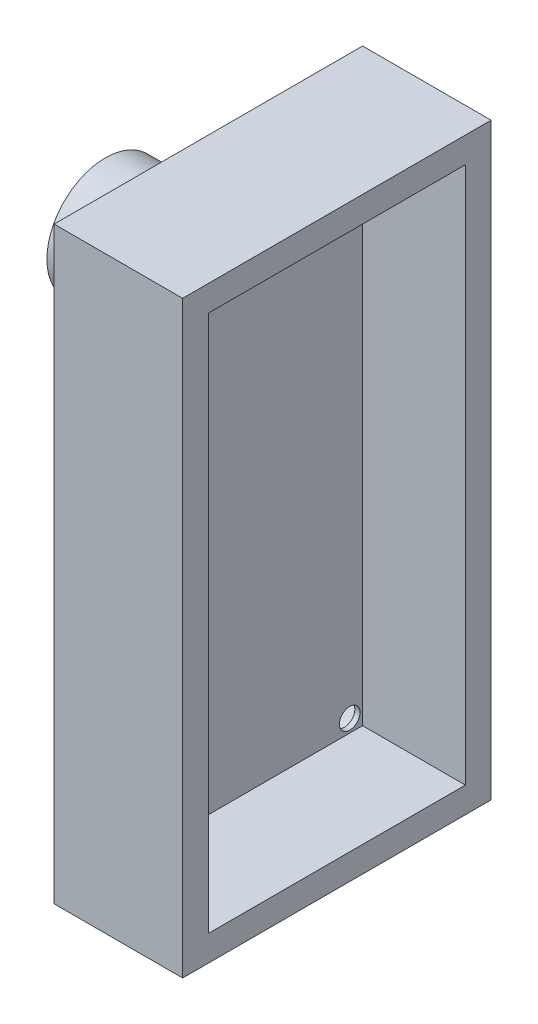
ISO-10303-21;
HEADER;
FILE_DESCRIPTION(('STEP AP214'),'2;1');
FILE_NAME('part.step','',(''),(''),'','','');
FILE_SCHEMA(('AUTOMOTIVE_DESIGN { 1 0 10303 214 1 1 1 1 }'));
ENDSEC;
DATA;
#1=APPLICATION_CONTEXT('core data for automotive mechanical design processes');
#2=APPLICATION_PROTOCOL_DEFINITION('international standard','automotive_design',2000,#1);
#3=PRODUCT_CONTEXT('',#1,'mechanical');
#4=PRODUCT('Part','Part','',(#3));
#5=PRODUCT_RELATED_PRODUCT_CATEGORY('part','',(#4));
#6=PRODUCT_DEFINITION_FORMATION('','',#4);
#7=PRODUCT_DEFINITION_CONTEXT('part definition',#1,'design');
#8=PRODUCT_DEFINITION('design','',#6,#7);
#9=PRODUCT_DEFINITION_SHAPE('','',#8);
#10=(LENGTH_UNIT() NAMED_UNIT(*) SI_UNIT(.MILLI.,.METRE.));
#11=(NAMED_UNIT(*) PLANE_ANGLE_UNIT() SI_UNIT($,.RADIAN.));
#12=(NAMED_UNIT(*) SI_UNIT($,.STERADIAN.) SOLID_ANGLE_UNIT());
#13=UNCERTAINTY_MEASURE_WITH_UNIT(LENGTH_MEASURE(1.E-05),#10,'distance_accuracy_value','');
#14=(GEOMETRIC_REPRESENTATION_CONTEXT(3) GLOBAL_UNCERTAINTY_ASSIGNED_CONTEXT((#13)) GLOBAL_UNIT_ASSIGNED_CONTEXT((#10,
#11,#12)) REPRESENTATION_CONTEXT('',''));
#15=CARTESIAN_POINT('',(0.,0.,0.));
#16=DIRECTION('',(0.,0.,1.));
#17=DIRECTION('',(1.,0.,0.));
#18=AXIS2_PLACEMENT_3D('',#15,#16,#17);
#19=CARTESIAN_POINT('',(5.,0.,0.));
#20=DIRECTION('',(-1.,0.,0.));
#21=DIRECTION('',(0.,0.,1.));
#22=AXIS2_PLACEMENT_3D('',#19,#20,#21);
#23=PLANE('',#22);
#24=DIRECTION('',(0.,1.,0.));
#25=VECTOR('',#24,1.);
#26=CARTESIAN_POINT('',(5.,-12.709853200062,11.9875854542043));
#27=LINE('',#26,#25);
#28=CARTESIAN_POINT('',(5.,-35.609853200062,11.9875854542043));
#29=VERTEX_POINT('',#28);
#30=CARTESIAN_POINT('',(5.,-12.709853200062,11.9875854542043));
#31=VERTEX_POINT('',#30);
#32=EDGE_CURVE('E145',#29,#31,#27,.T.);
#33=ORIENTED_EDGE('',*,*,#32,.T.);
#34=DIRECTION('',(0.,0.,1.));
#35=VECTOR('',#34,1.);
#36=CARTESIAN_POINT('',(5.,-12.709853200062,11.9875854542043));
#37=LINE('',#36,#35);
#38=CARTESIAN_POINT('',(5.,-12.709853200062,23.9875854542043));
#39=VERTEX_POINT('',#38);
#40=EDGE_CURVE('E89',#31,#39,#37,.T.);
#41=ORIENTED_EDGE('',*,*,#40,.T.);
#42=DIRECTION('',(0.,-1.,0.));
#43=VECTOR('',#42,1.);
#44=CARTESIAN_POINT('',(5.,-12.709853200062,23.9875854542043));
#45=LINE('',#44,#43);
#46=CARTESIAN_POINT('',(5.,-35.609853200062,23.9875854542043));
#47=VERTEX_POINT('',#46);
#48=EDGE_CURVE('E148',#39,#47,#45,.T.);
#49=ORIENTED_EDGE('',*,*,#48,.T.);
#50=DIRECTION('',(0.,0.,-1.));
#51=VECTOR('',#50,1.);
#52=CARTESIAN_POINT('',(5.,-35.609853200062,11.9875854542043));
#53=LINE('',#52,#51);
#54=EDGE_CURVE('E61',#47,#29,#53,.T.);
#55=ORIENTED_EDGE('',*,*,#54,.T.);
#56=EDGE_LOOP('',(#33,#41,#49,#55));
#57=FACE_BOUND('',#56,.T.);
#58=DIRECTION('',(0.,1.,0.));
#59=VECTOR('',#58,1.);
#60=CARTESIAN_POINT('',(5.,0.,12.9875854542043));
#61=LINE('',#60,#59);
#62=CARTESIAN_POINT('',(5.,-34.609853200062,12.9875854542043));
#63=VERTEX_POINT('',#62);
#64=CARTESIAN_POINT('',(5.,-13.709853200062,12.9875854542043));
#65=VERTEX_POINT('',#64);
#66=EDGE_CURVE('E134',#63,#65,#61,.T.);
#67=ORIENTED_EDGE('',*,*,#66,.F.);
#68=DIRECTION('',(0.,0.,-1.));
#69=VECTOR('',#68,1.);
#70=CARTESIAN_POINT('',(5.,-34.609853200062,0.));
#71=LINE('',#70,#69);
#72=CARTESIAN_POINT('',(5.,-34.609853200062,22.9875854542043));
#73=VERTEX_POINT('',#72);
#74=EDGE_CURVE('E143',#73,#63,#71,.T.);
#75=ORIENTED_EDGE('',*,*,#74,.F.);
#76=DIRECTION('',(0.,-1.,0.));
#77=VECTOR('',#76,1.);
#78=CARTESIAN_POINT('',(5.,0.,22.9875854542043));
#79=LINE('',#78,#77);
#80=CARTESIAN_POINT('',(5.,-13.709853200062,22.9875854542043));
#81=VERTEX_POINT('',#80);
#82=EDGE_CURVE('E141',#81,#73,#79,.T.);
#83=ORIENTED_EDGE('',*,*,#82,.F.);
#84=DIRECTION('',(0.,0.,1.));
#85=VECTOR('',#84,1.);
#86=CARTESIAN_POINT('',(5.,-13.709853200062,0.));
#87=LINE('',#86,#85);
#88=EDGE_CURVE('E126',#65,#81,#87,.T.);
#89=ORIENTED_EDGE('',*,*,#88,.F.);
#90=EDGE_LOOP('',(#67,#75,#83,#89));
#91=FACE_BOUND('',#90,.T.);
#92=ADVANCED_FACE('F37',(#57,#91),#23,.F.);
#93=CARTESIAN_POINT('',(5.,-12.709853200062,11.9875854542043));
#94=DIRECTION('',(0.,0.,1.));
#95=DIRECTION('',(0.,-1.,0.));
#96=AXIS2_PLACEMENT_3D('',#93,#94,#95);
#97=PLANE('',#96);
#98=DIRECTION('',(0.,1.,0.));
#99=VECTOR('',#98,1.);
#100=CARTESIAN_POINT('',(0.,-12.709853200062,11.9875854542043));
#101=LINE('',#100,#99);
#102=CARTESIAN_POINT('',(0.,-35.609853200062,11.9875854542043));
#103=VERTEX_POINT('',#102);
#104=CARTESIAN_POINT('',(0.,-12.709853200062,11.9875854542043));
#105=VERTEX_POINT('',#104);
#106=EDGE_CURVE('E152',#103,#105,#101,.T.);
#107=ORIENTED_EDGE('',*,*,#106,.T.);
#108=DIRECTION('',(-1.,0.,0.));
#109=VECTOR('',#108,1.);
#110=CARTESIAN_POINT('',(5.,-12.709853200062,11.9875854542043));
#111=LINE('',#110,#109);
#112=EDGE_CURVE('E11',#31,#105,#111,.T.);
#113=ORIENTED_EDGE('',*,*,#112,.F.);
#114=ORIENTED_EDGE('',*,*,#32,.F.);
#115=DIRECTION('',(-1.,0.,0.));
#116=VECTOR('',#115,1.);
#117=CARTESIAN_POINT('',(5.,-35.609853200062,11.9875854542043));
#118=LINE('',#117,#116);
#119=EDGE_CURVE('E151',#29,#103,#118,.T.);
#120=ORIENTED_EDGE('',*,*,#119,.T.);
#121=EDGE_LOOP('',(#107,#113,#114,#120));
#122=FACE_BOUND('',#121,.T.);
#123=ADVANCED_FACE('F39',(#122),#97,.F.);
#124=CARTESIAN_POINT('',(5.,-12.709853200062,11.9875854542043));
#125=DIRECTION('',(0.,-1.,0.));
#126=DIRECTION('',(0.,0.,-1.));
#127=AXIS2_PLACEMENT_3D('',#124,#125,#126);
#128=PLANE('',#127);
#129=DIRECTION('',(0.,0.,1.));
#130=VECTOR('',#129,1.);
#131=CARTESIAN_POINT('',(0.,-12.709853200062,11.9875854542043));
#132=LINE('',#131,#130);
#133=CARTESIAN_POINT('',(0.,-12.709853200062,23.9875854542043));
#134=VERTEX_POINT('',#133);
#135=EDGE_CURVE('E155',#105,#134,#132,.T.);
#136=ORIENTED_EDGE('',*,*,#135,.T.);
#137=DIRECTION('',(-1.,0.,0.));
#138=VECTOR('',#137,1.);
#139=CARTESIAN_POINT('',(5.,-12.709853200062,23.9875854542043));
#140=LINE('',#139,#138);
#141=EDGE_CURVE('E45',#39,#134,#140,.T.);
#142=ORIENTED_EDGE('',*,*,#141,.F.);
#143=ORIENTED_EDGE('',*,*,#40,.F.);
#144=ORIENTED_EDGE('',*,*,#112,.T.);
#145=EDGE_LOOP('',(#136,#142,#143,#144));
#146=FACE_BOUND('',#145,.T.);
#147=ADVANCED_FACE('F184',(#146),#128,.F.);
#148=CARTESIAN_POINT('',(5.,-12.709853200062,23.9875854542043));
#149=DIRECTION('',(0.,0.,-1.));
#150=DIRECTION('',(-1.,0.,0.));
#151=AXIS2_PLACEMENT_3D('',#148,#149,#150);
#152=PLANE('',#151);
#153=DIRECTION('',(0.,-1.,0.));
#154=VECTOR('',#153,1.);
#155=CARTESIAN_POINT('',(0.,-12.709853200062,23.9875854542043));
#156=LINE('',#155,#154);
#157=CARTESIAN_POINT('',(0.,-35.609853200062,23.9875854542043));
#158=VERTEX_POINT('',#157);
#159=EDGE_CURVE('E157',#134,#158,#156,.T.);
#160=ORIENTED_EDGE('',*,*,#159,.T.);
#161=DIRECTION('',(-1.,0.,0.));
#162=VECTOR('',#161,1.);
#163=CARTESIAN_POINT('',(5.,-35.609853200062,23.9875854542043));
#164=LINE('',#163,#162);
#165=EDGE_CURVE('E161',#47,#158,#164,.T.);
#166=ORIENTED_EDGE('',*,*,#165,.F.);
#167=ORIENTED_EDGE('',*,*,#48,.F.);
#168=ORIENTED_EDGE('',*,*,#141,.T.);
#169=EDGE_LOOP('',(#160,#166,#167,#168));
#170=FACE_BOUND('',#169,.T.);
#171=ADVANCED_FACE('F166',(#170),#152,.F.);
#172=CARTESIAN_POINT('',(5.,-35.609853200062,11.9875854542043));
#173=DIRECTION('',(0.,1.,0.));
#174=DIRECTION('',(0.,0.,1.));
#175=AXIS2_PLACEMENT_3D('',#172,#173,#174);
#176=PLANE('',#175);
#177=DIRECTION('',(0.,0.,-1.));
#178=VECTOR('',#177,1.);
#179=CARTESIAN_POINT('',(0.,-35.609853200062,11.9875854542043));
#180=LINE('',#179,#178);
#181=EDGE_CURVE('E82',#158,#103,#180,.T.);
#182=ORIENTED_EDGE('',*,*,#181,.T.);
#183=ORIENTED_EDGE('',*,*,#119,.F.);
#184=ORIENTED_EDGE('',*,*,#54,.F.);
#185=ORIENTED_EDGE('',*,*,#165,.T.);
#186=EDGE_LOOP('',(#182,#183,#184,#185));
#187=FACE_BOUND('',#186,.T.);
#188=ADVANCED_FACE('F174',(#187),#176,.F.);
#189=CARTESIAN_POINT('',(0.,0.,0.));
#190=DIRECTION('',(-1.,0.,0.));
#191=DIRECTION('',(0.,0.,1.));
#192=AXIS2_PLACEMENT_3D('',#189,#190,#191);
#193=PLANE('',#192);
#194=CARTESIAN_POINT('',(0.,-34.109853200062,22.4875854542043));
#195=DIRECTION('',(-1.,0.,0.));
#196=DIRECTION('',(0.,0.,1.));
#197=AXIS2_PLACEMENT_3D('',#194,#195,#196);
#198=CIRCLE('',#197,1.);
#199=CARTESIAN_POINT('',(0.,-34.109853200062,23.4875854542043));
#200=VERTEX_POINT('',#199);
#201=EDGE_CURVE('E285',#200,#200,#198,.T.);
#202=ORIENTED_EDGE('',*,*,#201,.F.);
#203=EDGE_LOOP('',(#202));
#204=FACE_BOUND('',#203,.T.);
#205=CARTESIAN_POINT('',(0.,-14.209853200062,13.4875854542043));
#206=DIRECTION('',(-1.,0.,0.));
#207=DIRECTION('',(0.,0.,1.));
#208=AXIS2_PLACEMENT_3D('',#205,#206,#207);
#209=CIRCLE('',#208,0.999999999999999);
#210=CARTESIAN_POINT('',(0.,-14.209853200062,14.4875854542043));
#211=VERTEX_POINT('',#210);
#212=EDGE_CURVE('E290',#211,#211,#209,.T.);
#213=ORIENTED_EDGE('',*,*,#212,.F.);
#214=EDGE_LOOP('',(#213));
#215=FACE_BOUND('',#214,.T.);
#216=CARTESIAN_POINT('',(0.,-14.209853200062,22.4875854542043));
#217=DIRECTION('',(-1.,0.,0.));
#218=DIRECTION('',(0.,0.,1.));
#219=AXIS2_PLACEMENT_3D('',#216,#217,#218);
#220=CIRCLE('',#219,1.);
#221=CARTESIAN_POINT('',(0.,-14.209853200062,23.4875854542043));
#222=VERTEX_POINT('',#221);
#223=EDGE_CURVE('E289',#222,#222,#220,.T.);
#224=ORIENTED_EDGE('',*,*,#223,.F.);
#225=EDGE_LOOP('',(#224));
#226=FACE_BOUND('',#225,.T.);
#227=CARTESIAN_POINT('',(0.,-34.109853200062,13.4875854542043));
#228=DIRECTION('',(-1.,0.,0.));
#229=DIRECTION('',(0.,0.,1.));
#230=AXIS2_PLACEMENT_3D('',#227,#228,#229);
#231=CIRCLE('',#230,1.);
#232=CARTESIAN_POINT('',(0.,-34.109853200062,14.4875854542043));
#233=VERTEX_POINT('',#232);
#234=EDGE_CURVE('E301',#233,#233,#231,.T.);
#235=ORIENTED_EDGE('',*,*,#234,.F.);
#236=EDGE_LOOP('',(#235));
#237=FACE_BOUND('',#236,.T.);
#238=CARTESIAN_POINT('',(0.,-17.7543605400589,17.9875854542043));
#239=DIRECTION('',(-1.,0.,0.));
#240=DIRECTION('',(0.,0.,1.));
#241=AXIS2_PLACEMENT_3D('',#238,#239,#240);
#242=CIRCLE('',#241,2.28);
#243=CARTESIAN_POINT('',(0.,-17.7543605400589,20.2675854542043));
#244=VERTEX_POINT('',#243);
#245=EDGE_CURVE('E307',#244,#244,#242,.T.);
#246=ORIENTED_EDGE('',*,*,#245,.F.);
#247=EDGE_LOOP('',(#246));
#248=FACE_BOUND('',#247,.T.);
#249=ORIENTED_EDGE('',*,*,#106,.F.);
#250=ORIENTED_EDGE('',*,*,#181,.F.);
#251=ORIENTED_EDGE('',*,*,#159,.F.);
#252=ORIENTED_EDGE('',*,*,#135,.F.);
#253=EDGE_LOOP('',(#249,#250,#251,#252));
#254=FACE_BOUND('',#253,.T.);
#255=ADVANCED_FACE('F170',(#204,#215,#226,#237,#248,#254),#193,.T.);
#256=CARTESIAN_POINT('',(5.,-12.709853200062,12.9875854542043));
#257=DIRECTION('',(0.,0.,1.));
#258=DIRECTION('',(0.,-1.,0.));
#259=AXIS2_PLACEMENT_3D('',#256,#257,#258);
#260=PLANE('',#259);
#261=DIRECTION('',(0.,1.,0.));
#262=VECTOR('',#261,1.);
#263=CARTESIAN_POINT('',(1.,0.,12.9875854542043));
#264=LINE('',#263,#262);
#265=CARTESIAN_POINT('',(1.,-34.609853200062,12.9875854542043));
#266=VERTEX_POINT('',#265);
#267=CARTESIAN_POINT('',(1.,-13.709853200062,12.9875854542043));
#268=VERTEX_POINT('',#267);
#269=EDGE_CURVE('E117',#266,#268,#264,.T.);
#270=ORIENTED_EDGE('',*,*,#269,.F.);
#271=DIRECTION('',(-1.,0.,0.));
#272=VECTOR('',#271,1.);
#273=CARTESIAN_POINT('',(5.,-34.609853200062,12.9875854542043));
#274=LINE('',#273,#272);
#275=EDGE_CURVE('E137',#63,#266,#274,.T.);
#276=ORIENTED_EDGE('',*,*,#275,.F.);
#277=ORIENTED_EDGE('',*,*,#66,.T.);
#278=DIRECTION('',(-1.,0.,0.));
#279=VECTOR('',#278,1.);
#280=CARTESIAN_POINT('',(5.,-13.709853200062,12.9875854542043));
#281=LINE('',#280,#279);
#282=EDGE_CURVE('E129',#65,#268,#281,.T.);
#283=ORIENTED_EDGE('',*,*,#282,.T.);
#284=EDGE_LOOP('',(#270,#276,#277,#283));
#285=FACE_BOUND('',#284,.T.);
#286=ADVANCED_FACE('F181',(#285),#260,.T.);
#287=CARTESIAN_POINT('',(5.,-13.709853200062,11.9875854542043));
#288=DIRECTION('',(0.,-1.,0.));
#289=DIRECTION('',(0.,0.,-1.));
#290=AXIS2_PLACEMENT_3D('',#287,#288,#289);
#291=PLANE('',#290);
#292=DIRECTION('',(0.,0.,1.));
#293=VECTOR('',#292,1.);
#294=CARTESIAN_POINT('',(1.,-13.709853200062,0.));
#295=LINE('',#294,#293);
#296=CARTESIAN_POINT('',(1.,-13.709853200062,22.9875854542043));
#297=VERTEX_POINT('',#296);
#298=EDGE_CURVE('E111',#268,#297,#295,.T.);
#299=ORIENTED_EDGE('',*,*,#298,.F.);
#300=ORIENTED_EDGE('',*,*,#282,.F.);
#301=ORIENTED_EDGE('',*,*,#88,.T.);
#302=DIRECTION('',(-1.,0.,0.));
#303=VECTOR('',#302,1.);
#304=CARTESIAN_POINT('',(5.,-13.709853200062,22.9875854542043));
#305=LINE('',#304,#303);
#306=EDGE_CURVE('E123',#81,#297,#305,.T.);
#307=ORIENTED_EDGE('',*,*,#306,.T.);
#308=EDGE_LOOP('',(#299,#300,#301,#307));
#309=FACE_BOUND('',#308,.T.);
#310=ADVANCED_FACE('F124',(#309),#291,.T.);
#311=CARTESIAN_POINT('',(5.,-12.709853200062,22.9875854542043));
#312=DIRECTION('',(0.,0.,-1.));
#313=DIRECTION('',(-1.,0.,0.));
#314=AXIS2_PLACEMENT_3D('',#311,#312,#313);
#315=PLANE('',#314);
#316=DIRECTION('',(0.,-1.,0.));
#317=VECTOR('',#316,1.);
#318=CARTESIAN_POINT('',(1.,0.,22.9875854542043));
#319=LINE('',#318,#317);
#320=CARTESIAN_POINT('',(1.,-34.609853200062,22.9875854542043));
#321=VERTEX_POINT('',#320);
#322=EDGE_CURVE('E115',#297,#321,#319,.T.);
#323=ORIENTED_EDGE('',*,*,#322,.F.);
#324=ORIENTED_EDGE('',*,*,#306,.F.);
#325=ORIENTED_EDGE('',*,*,#82,.T.);
#326=DIRECTION('',(-1.,0.,0.));
#327=VECTOR('',#326,1.);
#328=CARTESIAN_POINT('',(5.,-34.609853200062,22.9875854542043));
#329=LINE('',#328,#327);
#330=EDGE_CURVE('E52',#73,#321,#329,.T.);
#331=ORIENTED_EDGE('',*,*,#330,.T.);
#332=EDGE_LOOP('',(#323,#324,#325,#331));
#333=FACE_BOUND('',#332,.T.);
#334=ADVANCED_FACE('F131',(#333),#315,.T.);
#335=CARTESIAN_POINT('',(5.,-34.609853200062,11.9875854542043));
#336=DIRECTION('',(0.,1.,0.));
#337=DIRECTION('',(0.,0.,1.));
#338=AXIS2_PLACEMENT_3D('',#335,#336,#337);
#339=PLANE('',#338);
#340=DIRECTION('',(0.,0.,-1.));
#341=VECTOR('',#340,1.);
#342=CARTESIAN_POINT('',(1.,-34.609853200062,0.));
#343=LINE('',#342,#341);
#344=EDGE_CURVE('E132',#321,#266,#343,.T.);
#345=ORIENTED_EDGE('',*,*,#344,.F.);
#346=ORIENTED_EDGE('',*,*,#330,.F.);
#347=ORIENTED_EDGE('',*,*,#74,.T.);
#348=ORIENTED_EDGE('',*,*,#275,.T.);
#349=EDGE_LOOP('',(#345,#346,#347,#348));
#350=FACE_BOUND('',#349,.T.);
#351=ADVANCED_FACE('F196',(#350),#339,.T.);
#352=CARTESIAN_POINT('',(1.,0.,0.));
#353=DIRECTION('',(-1.,0.,0.));
#354=DIRECTION('',(0.,0.,1.));
#355=AXIS2_PLACEMENT_3D('',#352,#353,#354);
#356=PLANE('',#355);
#357=CARTESIAN_POINT('',(1.,-14.209853200062,22.4875854542043));
#358=DIRECTION('',(-1.,0.,0.));
#359=DIRECTION('',(0.,0.,1.));
#360=AXIS2_PLACEMENT_3D('',#357,#358,#359);
#361=CIRCLE('',#360,0.400000000000002);
#362=CARTESIAN_POINT('',(1.,-14.209853200062,22.8875854542043));
#363=VERTEX_POINT('',#362);
#364=EDGE_CURVE('E269',#363,#363,#361,.T.);
#365=ORIENTED_EDGE('',*,*,#364,.T.);
#366=EDGE_LOOP('',(#365));
#367=FACE_BOUND('',#366,.T.);
#368=CARTESIAN_POINT('',(1.,-34.109853200062,13.4875854542043));
#369=DIRECTION('',(-1.,0.,0.));
#370=DIRECTION('',(0.,0.,1.));
#371=AXIS2_PLACEMENT_3D('',#368,#369,#370);
#372=CIRCLE('',#371,0.399999999999999);
#373=CARTESIAN_POINT('',(1.,-34.109853200062,13.8875854542043));
#374=VERTEX_POINT('',#373);
#375=EDGE_CURVE('E270',#374,#374,#372,.T.);
#376=ORIENTED_EDGE('',*,*,#375,.T.);
#377=EDGE_LOOP('',(#376));
#378=FACE_BOUND('',#377,.T.);
#379=CARTESIAN_POINT('',(1.,-34.109853200062,22.4875854542043));
#380=DIRECTION('',(-1.,0.,0.));
#381=DIRECTION('',(0.,0.,1.));
#382=AXIS2_PLACEMENT_3D('',#379,#380,#381);
#383=CIRCLE('',#382,0.400000000000001);
#384=CARTESIAN_POINT('',(1.,-34.109853200062,22.8875854542043));
#385=VERTEX_POINT('',#384);
#386=EDGE_CURVE('E271',#385,#385,#383,.T.);
#387=ORIENTED_EDGE('',*,*,#386,.T.);
#388=EDGE_LOOP('',(#387));
#389=FACE_BOUND('',#388,.T.);
#390=CARTESIAN_POINT('',(1.,-14.209853200062,13.4875854542043));
#391=DIRECTION('',(-1.,0.,0.));
#392=DIRECTION('',(0.,0.,1.));
#393=AXIS2_PLACEMENT_3D('',#390,#391,#392);
#394=CIRCLE('',#393,0.399999999999999);
#395=CARTESIAN_POINT('',(1.,-14.209853200062,13.8875854542043));
#396=VERTEX_POINT('',#395);
#397=EDGE_CURVE('E282',#396,#396,#394,.T.);
#398=ORIENTED_EDGE('',*,*,#397,.T.);
#399=EDGE_LOOP('',(#398));
#400=FACE_BOUND('',#399,.T.);
#401=ORIENTED_EDGE('',*,*,#269,.T.);
#402=ORIENTED_EDGE('',*,*,#298,.T.);
#403=ORIENTED_EDGE('',*,*,#322,.T.);
#404=ORIENTED_EDGE('',*,*,#344,.T.);
#405=EDGE_LOOP('',(#401,#402,#403,#404));
#406=FACE_BOUND('',#405,.T.);
#407=ADVANCED_FACE('F113',(#367,#378,#389,#400,#406),#356,.F.);
#408=CARTESIAN_POINT('',(-4.,-17.7543605400589,17.9875854542043));
#409=DIRECTION('',(1.,0.,0.));
#410=DIRECTION('',(0.,0.,-1.));
#411=AXIS2_PLACEMENT_3D('',#408,#409,#410);
#412=CYLINDRICAL_SURFACE('',#411,2.28);
#413=CARTESIAN_POINT('',(-4.,-17.7543605400589,17.9875854542043));
#414=DIRECTION('',(-1.,0.,0.));
#415=DIRECTION('',(0.,0.,1.));
#416=AXIS2_PLACEMENT_3D('',#413,#414,#415);
#417=CIRCLE('',#416,2.28);
#418=CARTESIAN_POINT('',(-4.,-17.7543605400589,20.2675854542043));
#419=VERTEX_POINT('',#418);
#420=EDGE_CURVE('E310',#419,#419,#417,.T.);
#421=ORIENTED_EDGE('',*,*,#420,.F.);
#422=EDGE_LOOP('',(#421));
#423=FACE_BOUND('',#422,.T.);
#424=ORIENTED_EDGE('',*,*,#245,.T.);
#425=EDGE_LOOP('',(#424));
#426=FACE_BOUND('',#425,.T.);
#427=ADVANCED_FACE('F195',(#423,#426),#412,.T.);
#428=CARTESIAN_POINT('',(-4.,0.,0.));
#429=DIRECTION('',(-1.,0.,0.));
#430=DIRECTION('',(0.,0.,1.));
#431=AXIS2_PLACEMENT_3D('',#428,#429,#430);
#432=PLANE('',#431);
#433=ORIENTED_EDGE('',*,*,#420,.T.);
#434=EDGE_LOOP('',(#433));
#435=FACE_BOUND('',#434,.T.);
#436=ADVANCED_FACE('F209',(#435),#432,.T.);
#437=CARTESIAN_POINT('',(0.8,-34.109853200062,13.4875854542043));
#438=DIRECTION('',(-1.,0.,0.));
#439=DIRECTION('',(0.,0.,1.));
#440=AXIS2_PLACEMENT_3D('',#437,#438,#439);
#441=CYLINDRICAL_SURFACE('',#440,1.);
#442=CARTESIAN_POINT('',(0.8,-34.109853200062,13.4875854542043));
#443=DIRECTION('',(-1.,0.,0.));
#444=DIRECTION('',(0.,0.,1.));
#445=AXIS2_PLACEMENT_3D('',#442,#443,#444);
#446=CIRCLE('',#445,1.);
#447=CARTESIAN_POINT('',(0.8,-34.109853200062,14.4875854542043));
#448=VERTEX_POINT('',#447);
#449=EDGE_CURVE('E304',#448,#448,#446,.T.);
#450=ORIENTED_EDGE('',*,*,#449,.F.);
#451=EDGE_LOOP('',(#450));
#452=FACE_BOUND('',#451,.T.);
#453=ORIENTED_EDGE('',*,*,#234,.T.);
#454=EDGE_LOOP('',(#453));
#455=FACE_BOUND('',#454,.T.);
#456=ADVANCED_FACE('F213',(#452,#455),#441,.F.);
#457=CARTESIAN_POINT('',(0.8,0.,0.));
#458=DIRECTION('',(-1.,0.,0.));
#459=DIRECTION('',(0.,0.,1.));
#460=AXIS2_PLACEMENT_3D('',#457,#458,#459);
#461=PLANE('',#460);
#462=CARTESIAN_POINT('',(0.8,-34.109853200062,13.4875854542043));
#463=DIRECTION('',(-1.,0.,0.));
#464=DIRECTION('',(0.,0.,1.));
#465=AXIS2_PLACEMENT_3D('',#462,#463,#464);
#466=CIRCLE('',#465,0.399999999999999);
#467=CARTESIAN_POINT('',(0.8,-34.109853200062,13.8875854542043));
#468=VERTEX_POINT('',#467);
#469=EDGE_CURVE('E351',#468,#468,#466,.T.);
#470=ORIENTED_EDGE('',*,*,#469,.F.);
#471=EDGE_LOOP('',(#470));
#472=FACE_BOUND('',#471,.T.);
#473=ORIENTED_EDGE('',*,*,#449,.T.);
#474=EDGE_LOOP('',(#473));
#475=FACE_BOUND('',#474,.T.);
#476=ADVANCED_FACE('F217',(#472,#475),#461,.T.);
#477=CARTESIAN_POINT('',(0.8,-14.209853200062,22.4875854542043));
#478=DIRECTION('',(-1.,0.,0.));
#479=DIRECTION('',(0.,0.,1.));
#480=AXIS2_PLACEMENT_3D('',#477,#478,#479);
#481=CYLINDRICAL_SURFACE('',#480,1.);
#482=CARTESIAN_POINT('',(0.8,-14.209853200062,22.4875854542043));
#483=DIRECTION('',(-1.,0.,0.));
#484=DIRECTION('',(0.,0.,1.));
#485=AXIS2_PLACEMENT_3D('',#482,#483,#484);
#486=CIRCLE('',#485,1.);
#487=CARTESIAN_POINT('',(0.8,-14.209853200062,23.4875854542043));
#488=VERTEX_POINT('',#487);
#489=EDGE_CURVE('E298',#488,#488,#486,.T.);
#490=ORIENTED_EDGE('',*,*,#489,.F.);
#491=EDGE_LOOP('',(#490));
#492=FACE_BOUND('',#491,.T.);
#493=ORIENTED_EDGE('',*,*,#223,.T.);
#494=EDGE_LOOP('',(#493));
#495=FACE_BOUND('',#494,.T.);
#496=ADVANCED_FACE('F221',(#492,#495),#481,.F.);
#497=CARTESIAN_POINT('',(0.8,0.,0.));
#498=DIRECTION('',(-1.,0.,0.));
#499=DIRECTION('',(0.,0.,1.));
#500=AXIS2_PLACEMENT_3D('',#497,#498,#499);
#501=PLANE('',#500);
#502=CARTESIAN_POINT('',(0.8,-14.209853200062,22.4875854542043));
#503=DIRECTION('',(-1.,0.,0.));
#504=DIRECTION('',(0.,0.,1.));
#505=AXIS2_PLACEMENT_3D('',#502,#503,#504);
#506=CIRCLE('',#505,0.400000000000002);
#507=CARTESIAN_POINT('',(0.8,-14.209853200062,22.8875854542043));
#508=VERTEX_POINT('',#507);
#509=EDGE_CURVE('E266',#508,#508,#506,.T.);
#510=ORIENTED_EDGE('',*,*,#509,.F.);
#511=EDGE_LOOP('',(#510));
#512=FACE_BOUND('',#511,.T.);
#513=ORIENTED_EDGE('',*,*,#489,.T.);
#514=EDGE_LOOP('',(#513));
#515=FACE_BOUND('',#514,.T.);
#516=ADVANCED_FACE('F225',(#512,#515),#501,.T.);
#517=CARTESIAN_POINT('',(0.8,-14.209853200062,13.4875854542043));
#518=DIRECTION('',(-1.,0.,0.));
#519=DIRECTION('',(0.,0.,1.));
#520=AXIS2_PLACEMENT_3D('',#517,#518,#519);
#521=CYLINDRICAL_SURFACE('',#520,0.999999999999999);
#522=CARTESIAN_POINT('',(0.8,-14.209853200062,13.4875854542043));
#523=DIRECTION('',(-1.,0.,0.));
#524=DIRECTION('',(0.,0.,1.));
#525=AXIS2_PLACEMENT_3D('',#522,#523,#524);
#526=CIRCLE('',#525,0.999999999999999);
#527=CARTESIAN_POINT('',(0.8,-14.209853200062,14.4875854542043));
#528=VERTEX_POINT('',#527);
#529=EDGE_CURVE('E286',#528,#528,#526,.T.);
#530=ORIENTED_EDGE('',*,*,#529,.F.);
#531=EDGE_LOOP('',(#530));
#532=FACE_BOUND('',#531,.T.);
#533=ORIENTED_EDGE('',*,*,#212,.T.);
#534=EDGE_LOOP('',(#533));
#535=FACE_BOUND('',#534,.T.);
#536=ADVANCED_FACE('F229',(#532,#535),#521,.F.);
#537=CARTESIAN_POINT('',(0.8,0.,0.));
#538=DIRECTION('',(-1.,0.,0.));
#539=DIRECTION('',(0.,0.,1.));
#540=AXIS2_PLACEMENT_3D('',#537,#538,#539);
#541=PLANE('',#540);
#542=CARTESIAN_POINT('',(0.8,-14.209853200062,13.4875854542043));
#543=DIRECTION('',(-1.,0.,0.));
#544=DIRECTION('',(0.,0.,1.));
#545=AXIS2_PLACEMENT_3D('',#542,#543,#544);
#546=CIRCLE('',#545,0.399999999999999);
#547=CARTESIAN_POINT('',(0.8,-14.209853200062,13.8875854542043));
#548=VERTEX_POINT('',#547);
#549=EDGE_CURVE('E274',#548,#548,#546,.T.);
#550=ORIENTED_EDGE('',*,*,#549,.F.);
#551=EDGE_LOOP('',(#550));
#552=FACE_BOUND('',#551,.T.);
#553=ORIENTED_EDGE('',*,*,#529,.T.);
#554=EDGE_LOOP('',(#553));
#555=FACE_BOUND('',#554,.T.);
#556=ADVANCED_FACE('F235',(#552,#555),#541,.T.);
#557=CARTESIAN_POINT('',(0.8,-34.109853200062,22.4875854542043));
#558=DIRECTION('',(-1.,0.,0.));
#559=DIRECTION('',(0.,0.,1.));
#560=AXIS2_PLACEMENT_3D('',#557,#558,#559);
#561=CYLINDRICAL_SURFACE('',#560,1.);
#562=CARTESIAN_POINT('',(0.8,-34.109853200062,22.4875854542043));
#563=DIRECTION('',(-1.,0.,0.));
#564=DIRECTION('',(0.,0.,1.));
#565=AXIS2_PLACEMENT_3D('',#562,#563,#564);
#566=CIRCLE('',#565,1.);
#567=CARTESIAN_POINT('',(0.8,-34.109853200062,23.4875854542043));
#568=VERTEX_POINT('',#567);
#569=EDGE_CURVE('E293',#568,#568,#566,.T.);
#570=ORIENTED_EDGE('',*,*,#569,.F.);
#571=EDGE_LOOP('',(#570));
#572=FACE_BOUND('',#571,.T.);
#573=ORIENTED_EDGE('',*,*,#201,.T.);
#574=EDGE_LOOP('',(#573));
#575=FACE_BOUND('',#574,.T.);
#576=ADVANCED_FACE('F231',(#572,#575),#561,.F.);
#577=CARTESIAN_POINT('',(0.8,0.,0.));
#578=DIRECTION('',(-1.,0.,0.));
#579=DIRECTION('',(0.,0.,1.));
#580=AXIS2_PLACEMENT_3D('',#577,#578,#579);
#581=PLANE('',#580);
#582=CARTESIAN_POINT('',(0.8,-34.109853200062,22.4875854542043));
#583=DIRECTION('',(-1.,0.,0.));
#584=DIRECTION('',(0.,0.,1.));
#585=AXIS2_PLACEMENT_3D('',#582,#583,#584);
#586=CIRCLE('',#585,0.400000000000001);
#587=CARTESIAN_POINT('',(0.8,-34.109853200062,22.8875854542043));
#588=VERTEX_POINT('',#587);
#589=EDGE_CURVE('E348',#588,#588,#586,.T.);
#590=ORIENTED_EDGE('',*,*,#589,.F.);
#591=EDGE_LOOP('',(#590));
#592=FACE_BOUND('',#591,.T.);
#593=ORIENTED_EDGE('',*,*,#569,.T.);
#594=EDGE_LOOP('',(#593));
#595=FACE_BOUND('',#594,.T.);
#596=ADVANCED_FACE('F234',(#592,#595),#581,.T.);
#597=CARTESIAN_POINT('',(1.6,-14.209853200062,13.4875854542043));
#598=DIRECTION('',(-1.,0.,0.));
#599=DIRECTION('',(0.,0.,1.));
#600=AXIS2_PLACEMENT_3D('',#597,#598,#599);
#601=CYLINDRICAL_SURFACE('',#600,0.399999999999999);
#602=ORIENTED_EDGE('',*,*,#549,.T.);
#603=EDGE_LOOP('',(#602));
#604=FACE_BOUND('',#603,.T.);
#605=ORIENTED_EDGE('',*,*,#397,.F.);
#606=EDGE_LOOP('',(#605));
#607=FACE_BOUND('',#606,.T.);
#608=ADVANCED_FACE('F239',(#604,#607),#601,.F.);
#609=CARTESIAN_POINT('',(1.6,-34.109853200062,22.4875854542043));
#610=DIRECTION('',(-1.,0.,0.));
#611=DIRECTION('',(0.,0.,1.));
#612=AXIS2_PLACEMENT_3D('',#609,#610,#611);
#613=CYLINDRICAL_SURFACE('',#612,0.400000000000001);
#614=ORIENTED_EDGE('',*,*,#589,.T.);
#615=EDGE_LOOP('',(#614));
#616=FACE_BOUND('',#615,.T.);
#617=ORIENTED_EDGE('',*,*,#386,.F.);
#618=EDGE_LOOP('',(#617));
#619=FACE_BOUND('',#618,.T.);
#620=ADVANCED_FACE('F249',(#616,#619),#613,.F.);
#621=CARTESIAN_POINT('',(1.6,-14.209853200062,22.4875854542043));
#622=DIRECTION('',(-1.,0.,0.));
#623=DIRECTION('',(0.,0.,1.));
#624=AXIS2_PLACEMENT_3D('',#621,#622,#623);
#625=CYLINDRICAL_SURFACE('',#624,0.400000000000002);
#626=ORIENTED_EDGE('',*,*,#509,.T.);
#627=EDGE_LOOP('',(#626));
#628=FACE_BOUND('',#627,.T.);
#629=ORIENTED_EDGE('',*,*,#364,.F.);
#630=EDGE_LOOP('',(#629));
#631=FACE_BOUND('',#630,.T.);
#632=ADVANCED_FACE('F253',(#628,#631),#625,.F.);
#633=CARTESIAN_POINT('',(1.6,-34.109853200062,13.4875854542043));
#634=DIRECTION('',(-1.,0.,0.));
#635=DIRECTION('',(0.,0.,1.));
#636=AXIS2_PLACEMENT_3D('',#633,#634,#635);
#637=CYLINDRICAL_SURFACE('',#636,0.399999999999999);
#638=ORIENTED_EDGE('',*,*,#469,.T.);
#639=EDGE_LOOP('',(#638));
#640=FACE_BOUND('',#639,.T.);
#641=ORIENTED_EDGE('',*,*,#375,.F.);
#642=EDGE_LOOP('',(#641));
#643=FACE_BOUND('',#642,.T.);
#644=ADVANCED_FACE('F255',(#640,#643),#637,.F.);
#645=CLOSED_SHELL('',(#92,#123,#147,#171,#188,#255,#286,#310,#334,#351,#407,#427,#436,#456,#476,
#496,#516,#536,#556,#576,#596,#608,#620,#632,#644));
#646=MANIFOLD_SOLID_BREP('B2',#645);
#647=ADVANCED_BREP_SHAPE_REPRESENTATION('',(#18,#646),#14);
#648=SHAPE_DEFINITION_REPRESENTATION(#9,#647);
ENDSEC;
END-ISO-10303-21;
